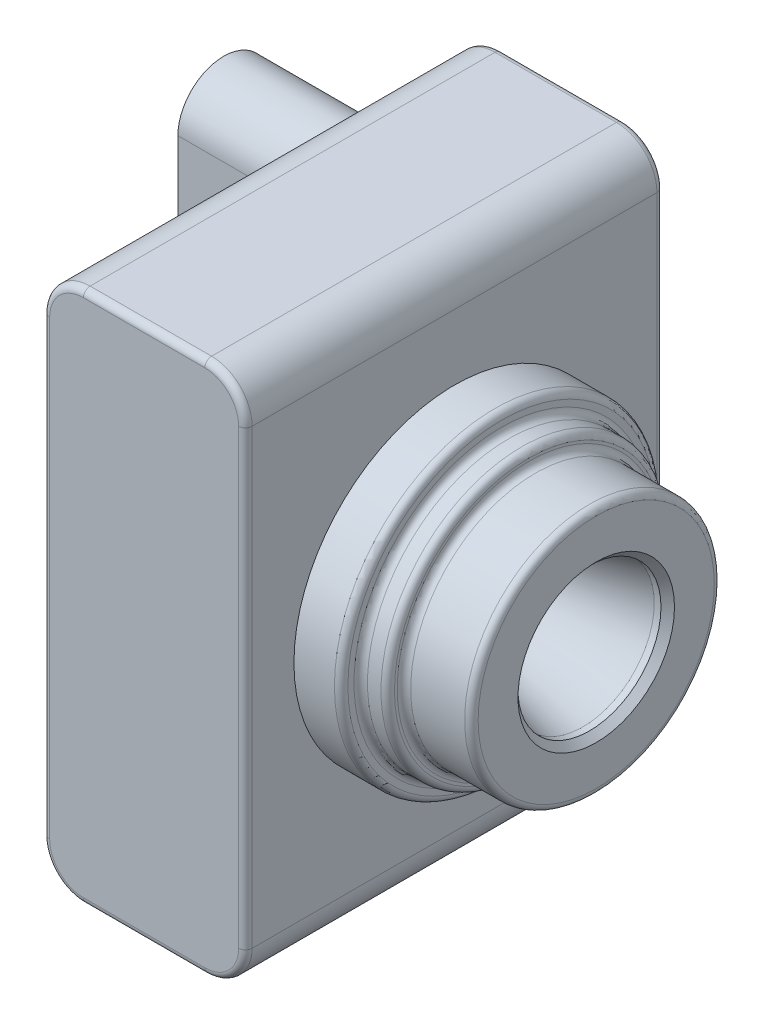
ISO-10303-21;
HEADER;
FILE_DESCRIPTION(('STEP AP214'),'2;1');
FILE_NAME('part.step','',(''),(''),'','','');
FILE_SCHEMA(('AUTOMOTIVE_DESIGN { 1 0 10303 214 1 1 1 1 }'));
ENDSEC;
DATA;
#1=APPLICATION_CONTEXT('core data for automotive mechanical design processes');
#2=APPLICATION_PROTOCOL_DEFINITION('international standard','automotive_design',2000,#1);
#3=PRODUCT_CONTEXT('',#1,'mechanical');
#4=PRODUCT('Part','Part','',(#3));
#5=PRODUCT_RELATED_PRODUCT_CATEGORY('part','',(#4));
#6=PRODUCT_DEFINITION_FORMATION('','',#4);
#7=PRODUCT_DEFINITION_CONTEXT('part definition',#1,'design');
#8=PRODUCT_DEFINITION('design','',#6,#7);
#9=PRODUCT_DEFINITION_SHAPE('','',#8);
#10=(LENGTH_UNIT() NAMED_UNIT(*) SI_UNIT(.MILLI.,.METRE.));
#11=(NAMED_UNIT(*) PLANE_ANGLE_UNIT() SI_UNIT($,.RADIAN.));
#12=(NAMED_UNIT(*) SI_UNIT($,.STERADIAN.) SOLID_ANGLE_UNIT());
#13=UNCERTAINTY_MEASURE_WITH_UNIT(LENGTH_MEASURE(1.E-05),#10,'distance_accuracy_value','');
#14=(GEOMETRIC_REPRESENTATION_CONTEXT(3) GLOBAL_UNCERTAINTY_ASSIGNED_CONTEXT((#13)) GLOBAL_UNIT_ASSIGNED_CONTEXT((#10,
#11,#12)) REPRESENTATION_CONTEXT('',''));
#15=CARTESIAN_POINT('',(0.,0.,0.));
#16=DIRECTION('',(0.,0.,1.));
#17=DIRECTION('',(1.,0.,0.));
#18=AXIS2_PLACEMENT_3D('',#15,#16,#17);
#19=CARTESIAN_POINT('',(-7.50000000000001,-16.75,31.));
#20=DIRECTION('',(1.,0.,0.));
#21=DIRECTION('',(0.,0.,-1.));
#22=AXIS2_PLACEMENT_3D('',#19,#20,#21);
#23=PLANE('',#22);
#24=DIRECTION('',(0.,0.,-1.));
#25=VECTOR('',#24,1.);
#26=CARTESIAN_POINT('',(-7.50000000000001,16.75,31.));
#27=LINE('',#26,#25);
#28=CARTESIAN_POINT('',(-7.50000000000001,16.75,30.5));
#29=VERTEX_POINT('',#28);
#30=CARTESIAN_POINT('',(-7.50000000000001,16.75,0.5));
#31=VERTEX_POINT('',#30);
#32=EDGE_CURVE('E217',#29,#31,#27,.T.);
#33=ORIENTED_EDGE('',*,*,#32,.T.);
#34=DIRECTION('',(0.,-1.,0.));
#35=VECTOR('',#34,1.);
#36=CARTESIAN_POINT('',(-7.50000000000001,-16.75,0.5));
#37=LINE('',#36,#35);
#38=CARTESIAN_POINT('',(-7.5,-16.75,0.5));
#39=VERTEX_POINT('',#38);
#40=EDGE_CURVE('E11',#31,#39,#37,.T.);
#41=ORIENTED_EDGE('',*,*,#40,.T.);
#42=DIRECTION('',(0.,0.,-1.));
#43=VECTOR('',#42,1.);
#44=CARTESIAN_POINT('',(-7.5,-16.75,31.));
#45=LINE('',#44,#43);
#46=CARTESIAN_POINT('',(-7.5,-16.75,30.5));
#47=VERTEX_POINT('',#46);
#48=EDGE_CURVE('E214',#47,#39,#45,.T.);
#49=ORIENTED_EDGE('',*,*,#48,.F.);
#50=DIRECTION('',(0.,-1.,0.));
#51=VECTOR('',#50,1.);
#52=CARTESIAN_POINT('',(-7.50000000000001,16.75,30.5));
#53=LINE('',#52,#51);
#54=EDGE_CURVE('E43',#47,#29,#53,.F.);
#55=ORIENTED_EDGE('',*,*,#54,.T.);
#56=EDGE_LOOP('',(#33,#41,#49,#55));
#57=FACE_BOUND('',#56,.T.);
#58=CARTESIAN_POINT('',(-7.50000000000001,13.15,7.6));
#59=DIRECTION('',(-1.,0.,0.));
#60=DIRECTION('',(0.,0.,1.));
#61=AXIS2_PLACEMENT_3D('',#58,#59,#60);
#62=CIRCLE('',#61,3.4);
#63=CARTESIAN_POINT('',(-7.50000000000001,13.15,11.));
#64=VERTEX_POINT('',#63);
#65=CARTESIAN_POINT('',(-7.50000000000001,13.15,4.2));
#66=VERTEX_POINT('',#65);
#67=EDGE_CURVE('E196',#64,#66,#62,.T.);
#68=ORIENTED_EDGE('',*,*,#67,.F.);
#69=DIRECTION('',(0.,1.,0.));
#70=VECTOR('',#69,1.);
#71=CARTESIAN_POINT('',(-7.50000000000001,13.15,11.));
#72=LINE('',#71,#70);
#73=CARTESIAN_POINT('',(-7.50000000000001,-11.85,11.));
#74=VERTEX_POINT('',#73);
#75=EDGE_CURVE('E193',#74,#64,#72,.T.);
#76=ORIENTED_EDGE('',*,*,#75,.F.);
#77=DIRECTION('',(0.,0.,1.));
#78=VECTOR('',#77,1.);
#79=CARTESIAN_POINT('',(-7.50000000000001,-11.85,11.));
#80=LINE('',#79,#78);
#81=CARTESIAN_POINT('',(-7.50000000000001,-11.85,4.2));
#82=VERTEX_POINT('',#81);
#83=EDGE_CURVE('E989',#82,#74,#80,.T.);
#84=ORIENTED_EDGE('',*,*,#83,.F.);
#85=DIRECTION('',(0.,-1.,0.));
#86=VECTOR('',#85,1.);
#87=CARTESIAN_POINT('',(-7.50000000000001,-11.85,4.2));
#88=LINE('',#87,#86);
#89=EDGE_CURVE('E991',#66,#82,#88,.T.);
#90=ORIENTED_EDGE('',*,*,#89,.F.);
#91=EDGE_LOOP('',(#68,#76,#84,#90));
#92=FACE_BOUND('',#91,.T.);
#93=ADVANCED_FACE('F34',(#57,#92),#23,.F.);
#94=CARTESIAN_POINT('',(4.5,-16.75,31.));
#95=DIRECTION('',(0.,0.,-1.));
#96=DIRECTION('',(-1.,0.,0.));
#97=AXIS2_PLACEMENT_3D('',#94,#95,#96);
#98=CYLINDRICAL_SURFACE('',#97,3.);
#99=DIRECTION('',(0.,0.,-1.));
#100=VECTOR('',#99,1.);
#101=CARTESIAN_POINT('',(4.5,-19.75,31.));
#102=LINE('',#101,#100);
#103=CARTESIAN_POINT('',(4.5,-19.75,30.5));
#104=VERTEX_POINT('',#103);
#105=CARTESIAN_POINT('',(4.5,-19.75,0.5));
#106=VERTEX_POINT('',#105);
#107=EDGE_CURVE('E207',#104,#106,#102,.T.);
#108=ORIENTED_EDGE('',*,*,#107,.T.);
#109=CARTESIAN_POINT('',(4.5,-16.75,0.5));
#110=DIRECTION('',(0.,0.,1.));
#111=DIRECTION('',(1.,0.,0.));
#112=AXIS2_PLACEMENT_3D('',#109,#110,#111);
#113=CIRCLE('',#112,3.);
#114=CARTESIAN_POINT('',(7.5,-16.75,0.5));
#115=VERTEX_POINT('',#114);
#116=EDGE_CURVE('E314',#106,#115,#113,.T.);
#117=ORIENTED_EDGE('',*,*,#116,.T.);
#118=DIRECTION('',(0.,0.,-1.));
#119=VECTOR('',#118,1.);
#120=CARTESIAN_POINT('',(7.5,-16.75,31.));
#121=LINE('',#120,#119);
#122=CARTESIAN_POINT('',(7.5,-16.75,30.5));
#123=VERTEX_POINT('',#122);
#124=EDGE_CURVE('E229',#123,#115,#121,.T.);
#125=ORIENTED_EDGE('',*,*,#124,.F.);
#126=CARTESIAN_POINT('',(4.5,-16.75,30.5));
#127=DIRECTION('',(0.,0.,1.));
#128=DIRECTION('',(1.,0.,0.));
#129=AXIS2_PLACEMENT_3D('',#126,#127,#128);
#130=CIRCLE('',#129,3.);
#131=EDGE_CURVE('E312',#123,#104,#130,.F.);
#132=ORIENTED_EDGE('',*,*,#131,.T.);
#133=EDGE_LOOP('',(#108,#117,#125,#132));
#134=FACE_BOUND('',#133,.T.);
#135=ADVANCED_FACE('F395',(#134),#98,.T.);
#136=CARTESIAN_POINT('',(7.5,-16.75,31.));
#137=DIRECTION('',(-1.,0.,0.));
#138=DIRECTION('',(0.,0.,1.));
#139=AXIS2_PLACEMENT_3D('',#136,#137,#138);
#140=PLANE('',#139);
#141=CARTESIAN_POINT('',(7.5,0.,15.5));
#142=DIRECTION('',(-1.,0.,0.));
#143=DIRECTION('',(0.,0.,1.));
#144=AXIS2_PLACEMENT_3D('',#141,#142,#143);
#145=CIRCLE('',#144,11.9);
#146=CARTESIAN_POINT('',(7.5,0.,27.4));
#147=VERTEX_POINT('',#146);
#148=EDGE_CURVE('E232',#147,#147,#145,.F.);
#149=ORIENTED_EDGE('',*,*,#148,.F.);
#150=EDGE_LOOP('',(#149));
#151=FACE_BOUND('',#150,.T.);
#152=ORIENTED_EDGE('',*,*,#124,.T.);
#153=DIRECTION('',(0.,1.,0.));
#154=VECTOR('',#153,1.);
#155=CARTESIAN_POINT('',(7.5,-16.75,0.5));
#156=LINE('',#155,#154);
#157=CARTESIAN_POINT('',(7.5,16.75,0.5));
#158=VERTEX_POINT('',#157);
#159=EDGE_CURVE('E310',#115,#158,#156,.T.);
#160=ORIENTED_EDGE('',*,*,#159,.T.);
#161=DIRECTION('',(0.,0.,-1.));
#162=VECTOR('',#161,1.);
#163=CARTESIAN_POINT('',(7.5,16.75,31.));
#164=LINE('',#163,#162);
#165=CARTESIAN_POINT('',(7.5,16.75,30.5));
#166=VERTEX_POINT('',#165);
#167=EDGE_CURVE('E226',#166,#158,#164,.T.);
#168=ORIENTED_EDGE('',*,*,#167,.F.);
#169=DIRECTION('',(0.,1.,0.));
#170=VECTOR('',#169,1.);
#171=CARTESIAN_POINT('',(7.5,-16.75,30.5));
#172=LINE('',#171,#170);
#173=EDGE_CURVE('E308',#166,#123,#172,.F.);
#174=ORIENTED_EDGE('',*,*,#173,.T.);
#175=EDGE_LOOP('',(#152,#160,#168,#174));
#176=FACE_BOUND('',#175,.T.);
#177=ADVANCED_FACE('F422',(#151,#176),#140,.F.);
#178=CARTESIAN_POINT('',(4.5,16.75,31.));
#179=DIRECTION('',(0.,0.,-1.));
#180=DIRECTION('',(-1.,0.,0.));
#181=AXIS2_PLACEMENT_3D('',#178,#179,#180);
#182=CYLINDRICAL_SURFACE('',#181,3.);
#183=ORIENTED_EDGE('',*,*,#167,.T.);
#184=CARTESIAN_POINT('',(4.5,16.75,0.5));
#185=DIRECTION('',(0.,0.,1.));
#186=DIRECTION('',(1.,0.,0.));
#187=AXIS2_PLACEMENT_3D('',#184,#185,#186);
#188=CIRCLE('',#187,3.);
#189=CARTESIAN_POINT('',(4.5,19.75,0.5));
#190=VERTEX_POINT('',#189);
#191=EDGE_CURVE('E306',#158,#190,#188,.T.);
#192=ORIENTED_EDGE('',*,*,#191,.T.);
#193=DIRECTION('',(0.,0.,-1.));
#194=VECTOR('',#193,1.);
#195=CARTESIAN_POINT('',(4.5,19.75,31.));
#196=LINE('',#195,#194);
#197=CARTESIAN_POINT('',(4.5,19.75,30.5));
#198=VERTEX_POINT('',#197);
#199=EDGE_CURVE('E223',#198,#190,#196,.T.);
#200=ORIENTED_EDGE('',*,*,#199,.F.);
#201=CARTESIAN_POINT('',(4.5,16.75,30.5));
#202=DIRECTION('',(0.,0.,1.));
#203=DIRECTION('',(1.,0.,0.));
#204=AXIS2_PLACEMENT_3D('',#201,#202,#203);
#205=CIRCLE('',#204,3.);
#206=EDGE_CURVE('E304',#198,#166,#205,.F.);
#207=ORIENTED_EDGE('',*,*,#206,.T.);
#208=EDGE_LOOP('',(#183,#192,#200,#207));
#209=FACE_BOUND('',#208,.T.);
#210=ADVANCED_FACE('F426',(#209),#182,.T.);
#211=CARTESIAN_POINT('',(-4.5,19.75,31.));
#212=DIRECTION('',(0.,-1.,0.));
#213=DIRECTION('',(0.,0.,-1.));
#214=AXIS2_PLACEMENT_3D('',#211,#212,#213);
#215=PLANE('',#214);
#216=ORIENTED_EDGE('',*,*,#199,.T.);
#217=DIRECTION('',(-1.,0.,0.));
#218=VECTOR('',#217,1.);
#219=CARTESIAN_POINT('',(-4.5,19.75,0.5));
#220=LINE('',#219,#218);
#221=CARTESIAN_POINT('',(-4.5,19.75,0.5));
#222=VERTEX_POINT('',#221);
#223=EDGE_CURVE('E302',#190,#222,#220,.T.);
#224=ORIENTED_EDGE('',*,*,#223,.T.);
#225=DIRECTION('',(0.,0.,-1.));
#226=VECTOR('',#225,1.);
#227=CARTESIAN_POINT('',(-4.5,19.75,31.));
#228=LINE('',#227,#226);
#229=CARTESIAN_POINT('',(-4.5,19.75,30.5));
#230=VERTEX_POINT('',#229);
#231=EDGE_CURVE('E220',#230,#222,#228,.T.);
#232=ORIENTED_EDGE('',*,*,#231,.F.);
#233=DIRECTION('',(-1.,0.,0.));
#234=VECTOR('',#233,1.);
#235=CARTESIAN_POINT('',(4.5,19.75,30.5));
#236=LINE('',#235,#234);
#237=EDGE_CURVE('E300',#230,#198,#236,.F.);
#238=ORIENTED_EDGE('',*,*,#237,.T.);
#239=EDGE_LOOP('',(#216,#224,#232,#238));
#240=FACE_BOUND('',#239,.T.);
#241=ADVANCED_FACE('F444',(#240),#215,.F.);
#242=CARTESIAN_POINT('',(-4.5,16.75,31.));
#243=DIRECTION('',(0.,0.,-1.));
#244=DIRECTION('',(-1.,0.,0.));
#245=AXIS2_PLACEMENT_3D('',#242,#243,#244);
#246=CYLINDRICAL_SURFACE('',#245,3.);
#247=ORIENTED_EDGE('',*,*,#231,.T.);
#248=CARTESIAN_POINT('',(-4.5,16.75,0.5));
#249=DIRECTION('',(0.,0.,1.));
#250=DIRECTION('',(1.,0.,0.));
#251=AXIS2_PLACEMENT_3D('',#248,#249,#250);
#252=CIRCLE('',#251,3.);
#253=EDGE_CURVE('E280',#222,#31,#252,.T.);
#254=ORIENTED_EDGE('',*,*,#253,.T.);
#255=ORIENTED_EDGE('',*,*,#32,.F.);
#256=CARTESIAN_POINT('',(-4.5,16.75,30.5));
#257=DIRECTION('',(0.,0.,1.));
#258=DIRECTION('',(1.,0.,0.));
#259=AXIS2_PLACEMENT_3D('',#256,#257,#258);
#260=CIRCLE('',#259,3.);
#261=EDGE_CURVE('E277',#29,#230,#260,.F.);
#262=ORIENTED_EDGE('',*,*,#261,.T.);
#263=EDGE_LOOP('',(#247,#254,#255,#262));
#264=FACE_BOUND('',#263,.T.);
#265=ADVANCED_FACE('F446',(#264),#246,.T.);
#266=CARTESIAN_POINT('',(-4.5,-16.75,31.));
#267=DIRECTION('',(0.,0.,-1.));
#268=DIRECTION('',(-1.,0.,0.));
#269=AXIS2_PLACEMENT_3D('',#266,#267,#268);
#270=CYLINDRICAL_SURFACE('',#269,3.);
#271=ORIENTED_EDGE('',*,*,#48,.T.);
#272=CARTESIAN_POINT('',(-4.5,-16.75,0.5));
#273=DIRECTION('',(0.,0.,1.));
#274=DIRECTION('',(1.,0.,0.));
#275=AXIS2_PLACEMENT_3D('',#272,#273,#274);
#276=CIRCLE('',#275,3.);
#277=CARTESIAN_POINT('',(-4.5,-19.75,0.5));
#278=VERTEX_POINT('',#277);
#279=EDGE_CURVE('E322',#39,#278,#276,.T.);
#280=ORIENTED_EDGE('',*,*,#279,.T.);
#281=DIRECTION('',(0.,0.,-1.));
#282=VECTOR('',#281,1.);
#283=CARTESIAN_POINT('',(-4.5,-19.75,31.));
#284=LINE('',#283,#282);
#285=CARTESIAN_POINT('',(-4.5,-19.75,30.5));
#286=VERTEX_POINT('',#285);
#287=EDGE_CURVE('E211',#286,#278,#284,.T.);
#288=ORIENTED_EDGE('',*,*,#287,.F.);
#289=CARTESIAN_POINT('',(-4.5,-16.75,30.5));
#290=DIRECTION('',(0.,0.,1.));
#291=DIRECTION('',(1.,0.,0.));
#292=AXIS2_PLACEMENT_3D('',#289,#290,#291);
#293=CIRCLE('',#292,3.);
#294=EDGE_CURVE('E320',#286,#47,#293,.F.);
#295=ORIENTED_EDGE('',*,*,#294,.T.);
#296=EDGE_LOOP('',(#271,#280,#288,#295));
#297=FACE_BOUND('',#296,.T.);
#298=ADVANCED_FACE('F469',(#297),#270,.T.);
#299=CARTESIAN_POINT('',(-4.5,-19.75,31.));
#300=DIRECTION('',(0.,1.,0.));
#301=DIRECTION('',(0.,0.,1.));
#302=AXIS2_PLACEMENT_3D('',#299,#300,#301);
#303=PLANE('',#302);
#304=ORIENTED_EDGE('',*,*,#287,.T.);
#305=DIRECTION('',(1.,0.,0.));
#306=VECTOR('',#305,1.);
#307=CARTESIAN_POINT('',(-4.5,-19.75,0.5));
#308=LINE('',#307,#306);
#309=EDGE_CURVE('E318',#278,#106,#308,.T.);
#310=ORIENTED_EDGE('',*,*,#309,.T.);
#311=ORIENTED_EDGE('',*,*,#107,.F.);
#312=DIRECTION('',(1.,0.,0.));
#313=VECTOR('',#312,1.);
#314=CARTESIAN_POINT('',(-4.5,-19.75,30.5));
#315=LINE('',#314,#313);
#316=EDGE_CURVE('E316',#104,#286,#315,.F.);
#317=ORIENTED_EDGE('',*,*,#316,.T.);
#318=EDGE_LOOP('',(#304,#310,#311,#317));
#319=FACE_BOUND('',#318,.T.);
#320=ADVANCED_FACE('F398',(#319),#303,.F.);
#321=CARTESIAN_POINT('',(4.5,-16.75,31.));
#322=DIRECTION('',(0.,0.,1.));
#323=DIRECTION('',(1.,0.,0.));
#324=AXIS2_PLACEMENT_3D('',#321,#322,#323);
#325=PLANE('',#324);
#326=DIRECTION('',(-1.,0.,0.));
#327=VECTOR('',#326,1.);
#328=CARTESIAN_POINT('',(-4.5,19.25,31.));
#329=LINE('',#328,#327);
#330=CARTESIAN_POINT('',(4.5,19.25,31.));
#331=VERTEX_POINT('',#330);
#332=CARTESIAN_POINT('',(-4.5,19.25,31.));
#333=VERTEX_POINT('',#332);
#334=EDGE_CURVE('E51',#331,#333,#329,.T.);
#335=ORIENTED_EDGE('',*,*,#334,.T.);
#336=CARTESIAN_POINT('',(-4.5,16.75,31.));
#337=DIRECTION('',(0.,0.,1.));
#338=DIRECTION('',(1.,0.,0.));
#339=AXIS2_PLACEMENT_3D('',#336,#337,#338);
#340=CIRCLE('',#339,2.5);
#341=CARTESIAN_POINT('',(-7.,16.75,31.));
#342=VERTEX_POINT('',#341);
#343=EDGE_CURVE('E336',#333,#342,#340,.T.);
#344=ORIENTED_EDGE('',*,*,#343,.T.);
#345=DIRECTION('',(0.,-1.,0.));
#346=VECTOR('',#345,1.);
#347=CARTESIAN_POINT('',(-7.,-16.75,31.));
#348=LINE('',#347,#346);
#349=CARTESIAN_POINT('',(-7.,-16.75,31.));
#350=VERTEX_POINT('',#349);
#351=EDGE_CURVE('E324',#342,#350,#348,.T.);
#352=ORIENTED_EDGE('',*,*,#351,.T.);
#353=CARTESIAN_POINT('',(-4.5,-16.75,31.));
#354=DIRECTION('',(0.,0.,1.));
#355=DIRECTION('',(1.,0.,0.));
#356=AXIS2_PLACEMENT_3D('',#353,#354,#355);
#357=CIRCLE('',#356,2.5);
#358=CARTESIAN_POINT('',(-4.5,-19.25,31.));
#359=VERTEX_POINT('',#358);
#360=EDGE_CURVE('E326',#350,#359,#357,.T.);
#361=ORIENTED_EDGE('',*,*,#360,.T.);
#362=DIRECTION('',(1.,0.,0.));
#363=VECTOR('',#362,1.);
#364=CARTESIAN_POINT('',(4.5,-19.25,31.));
#365=LINE('',#364,#363);
#366=CARTESIAN_POINT('',(4.5,-19.25,31.));
#367=VERTEX_POINT('',#366);
#368=EDGE_CURVE('E328',#359,#367,#365,.T.);
#369=ORIENTED_EDGE('',*,*,#368,.T.);
#370=CARTESIAN_POINT('',(4.5,-16.75,31.));
#371=DIRECTION('',(0.,0.,1.));
#372=DIRECTION('',(1.,0.,0.));
#373=AXIS2_PLACEMENT_3D('',#370,#371,#372);
#374=CIRCLE('',#373,2.5);
#375=CARTESIAN_POINT('',(7.,-16.75,31.));
#376=VERTEX_POINT('',#375);
#377=EDGE_CURVE('E330',#367,#376,#374,.T.);
#378=ORIENTED_EDGE('',*,*,#377,.T.);
#379=DIRECTION('',(0.,1.,0.));
#380=VECTOR('',#379,1.);
#381=CARTESIAN_POINT('',(7.,16.75,31.));
#382=LINE('',#381,#380);
#383=CARTESIAN_POINT('',(7.,16.75,31.));
#384=VERTEX_POINT('',#383);
#385=EDGE_CURVE('E332',#376,#384,#382,.T.);
#386=ORIENTED_EDGE('',*,*,#385,.T.);
#387=CARTESIAN_POINT('',(4.5,16.75,31.));
#388=DIRECTION('',(0.,0.,1.));
#389=DIRECTION('',(1.,0.,0.));
#390=AXIS2_PLACEMENT_3D('',#387,#388,#389);
#391=CIRCLE('',#390,2.5);
#392=EDGE_CURVE('E56',#384,#331,#391,.T.);
#393=ORIENTED_EDGE('',*,*,#392,.T.);
#394=EDGE_LOOP('',(#335,#344,#352,#361,#369,#378,#386,#393));
#395=FACE_BOUND('',#394,.T.);
#396=ADVANCED_FACE('F460',(#395),#325,.T.);
#397=CARTESIAN_POINT('',(4.5,-16.75,0.));
#398=DIRECTION('',(0.,0.,1.));
#399=DIRECTION('',(1.,0.,0.));
#400=AXIS2_PLACEMENT_3D('',#397,#398,#399);
#401=PLANE('',#400);
#402=DIRECTION('',(0.,-1.,0.));
#403=VECTOR('',#402,1.);
#404=CARTESIAN_POINT('',(-7.,-16.75,0.));
#405=LINE('',#404,#403);
#406=CARTESIAN_POINT('',(-7.,-16.75,0.));
#407=VERTEX_POINT('',#406);
#408=CARTESIAN_POINT('',(-7.,16.75,0.));
#409=VERTEX_POINT('',#408);
#410=EDGE_CURVE('E283',#407,#409,#405,.F.);
#411=ORIENTED_EDGE('',*,*,#410,.T.);
#412=CARTESIAN_POINT('',(-4.5,16.75,0.));
#413=DIRECTION('',(0.,0.,1.));
#414=DIRECTION('',(1.,0.,0.));
#415=AXIS2_PLACEMENT_3D('',#412,#413,#414);
#416=CIRCLE('',#415,2.5);
#417=CARTESIAN_POINT('',(-4.5,19.25,0.));
#418=VERTEX_POINT('',#417);
#419=EDGE_CURVE('E297',#409,#418,#416,.F.);
#420=ORIENTED_EDGE('',*,*,#419,.T.);
#421=DIRECTION('',(-1.,0.,0.));
#422=VECTOR('',#421,1.);
#423=CARTESIAN_POINT('',(4.5,19.25,0.));
#424=LINE('',#423,#422);
#425=CARTESIAN_POINT('',(4.5,19.25,0.));
#426=VERTEX_POINT('',#425);
#427=EDGE_CURVE('E295',#418,#426,#424,.F.);
#428=ORIENTED_EDGE('',*,*,#427,.T.);
#429=CARTESIAN_POINT('',(4.5,16.75,0.));
#430=DIRECTION('',(0.,0.,1.));
#431=DIRECTION('',(1.,0.,0.));
#432=AXIS2_PLACEMENT_3D('',#429,#430,#431);
#433=CIRCLE('',#432,2.5);
#434=CARTESIAN_POINT('',(7.,16.75,0.));
#435=VERTEX_POINT('',#434);
#436=EDGE_CURVE('E293',#426,#435,#433,.F.);
#437=ORIENTED_EDGE('',*,*,#436,.T.);
#438=DIRECTION('',(0.,1.,0.));
#439=VECTOR('',#438,1.);
#440=CARTESIAN_POINT('',(7.,-16.75,0.));
#441=LINE('',#440,#439);
#442=CARTESIAN_POINT('',(7.,-16.75,0.));
#443=VERTEX_POINT('',#442);
#444=EDGE_CURVE('E291',#435,#443,#441,.F.);
#445=ORIENTED_EDGE('',*,*,#444,.T.);
#446=CARTESIAN_POINT('',(4.5,-16.75,0.));
#447=DIRECTION('',(0.,0.,1.));
#448=DIRECTION('',(1.,0.,0.));
#449=AXIS2_PLACEMENT_3D('',#446,#447,#448);
#450=CIRCLE('',#449,2.5);
#451=CARTESIAN_POINT('',(4.5,-19.25,0.));
#452=VERTEX_POINT('',#451);
#453=EDGE_CURVE('E289',#443,#452,#450,.F.);
#454=ORIENTED_EDGE('',*,*,#453,.T.);
#455=DIRECTION('',(1.,0.,0.));
#456=VECTOR('',#455,1.);
#457=CARTESIAN_POINT('',(4.5,-19.25,0.));
#458=LINE('',#457,#456);
#459=CARTESIAN_POINT('',(-4.5,-19.25,0.));
#460=VERTEX_POINT('',#459);
#461=EDGE_CURVE('E287',#452,#460,#458,.F.);
#462=ORIENTED_EDGE('',*,*,#461,.T.);
#463=CARTESIAN_POINT('',(-4.5,-16.75,0.));
#464=DIRECTION('',(0.,0.,1.));
#465=DIRECTION('',(1.,0.,0.));
#466=AXIS2_PLACEMENT_3D('',#463,#464,#465);
#467=CIRCLE('',#466,2.5);
#468=EDGE_CURVE('E285',#460,#407,#467,.F.);
#469=ORIENTED_EDGE('',*,*,#468,.T.);
#470=EDGE_LOOP('',(#411,#420,#428,#437,#445,#454,#462,#469));
#471=FACE_BOUND('',#470,.T.);
#472=ADVANCED_FACE('F413',(#471),#401,.F.);
#473=CARTESIAN_POINT('',(11.,0.,15.5));
#474=DIRECTION('',(-1.,0.,0.));
#475=DIRECTION('',(0.,0.,1.));
#476=AXIS2_PLACEMENT_3D('',#473,#474,#475);
#477=CYLINDRICAL_SURFACE('',#476,11.9);
#478=CARTESIAN_POINT('',(10.5,0.,15.5));
#479=DIRECTION('',(1.,0.,0.));
#480=DIRECTION('',(0.,0.,-1.));
#481=AXIS2_PLACEMENT_3D('',#478,#479,#480);
#482=CIRCLE('',#481,11.9);
#483=CARTESIAN_POINT('',(10.5,0.,3.6));
#484=VERTEX_POINT('',#483);
#485=EDGE_CURVE('E262',#484,#484,#482,.F.);
#486=ORIENTED_EDGE('',*,*,#485,.T.);
#487=EDGE_LOOP('',(#486));
#488=FACE_BOUND('',#487,.T.);
#489=ORIENTED_EDGE('',*,*,#148,.T.);
#490=EDGE_LOOP('',(#489));
#491=FACE_BOUND('',#490,.T.);
#492=ADVANCED_FACE('F467',(#488,#491),#477,.T.);
#493=CARTESIAN_POINT('',(11.,0.,15.5));
#494=DIRECTION('',(1.,0.,0.));
#495=DIRECTION('',(0.,0.,-1.));
#496=AXIS2_PLACEMENT_3D('',#493,#494,#495);
#497=PLANE('',#496);
#498=CARTESIAN_POINT('',(11.,0.,15.5));
#499=DIRECTION('',(1.,0.,0.));
#500=DIRECTION('',(0.,0.,-1.));
#501=AXIS2_PLACEMENT_3D('',#498,#499,#500);
#502=CIRCLE('',#501,11.4);
#503=CARTESIAN_POINT('',(11.,0.,4.1));
#504=VERTEX_POINT('',#503);
#505=EDGE_CURVE('E259',#504,#504,#502,.T.);
#506=ORIENTED_EDGE('',*,*,#505,.T.);
#507=EDGE_LOOP('',(#506));
#508=FACE_BOUND('',#507,.T.);
#509=CARTESIAN_POINT('',(11.,0.,15.5));
#510=DIRECTION('',(1.,0.,0.));
#511=DIRECTION('',(0.,0.,-1.));
#512=AXIS2_PLACEMENT_3D('',#509,#510,#511);
#513=CIRCLE('',#512,10.95);
#514=CARTESIAN_POINT('',(11.,0.,4.55));
#515=VERTEX_POINT('',#514);
#516=EDGE_CURVE('E244',#515,#515,#513,.F.);
#517=ORIENTED_EDGE('',*,*,#516,.T.);
#518=EDGE_LOOP('',(#517));
#519=FACE_BOUND('',#518,.T.);
#520=ADVANCED_FACE('F724',(#508,#519),#497,.T.);
#521=CARTESIAN_POINT('',(13.,0.,15.5));
#522=DIRECTION('',(-1.,0.,0.));
#523=DIRECTION('',(0.,0.,1.));
#524=AXIS2_PLACEMENT_3D('',#521,#522,#523);
#525=CYLINDRICAL_SURFACE('',#524,10.45);
#526=CARTESIAN_POINT('',(12.5,0.,15.5));
#527=DIRECTION('',(1.,0.,0.));
#528=DIRECTION('',(0.,0.,-1.));
#529=AXIS2_PLACEMENT_3D('',#526,#527,#528);
#530=CIRCLE('',#529,10.45);
#531=CARTESIAN_POINT('',(12.5,0.,5.05));
#532=VERTEX_POINT('',#531);
#533=EDGE_CURVE('E256',#532,#532,#530,.F.);
#534=ORIENTED_EDGE('',*,*,#533,.T.);
#535=EDGE_LOOP('',(#534));
#536=FACE_BOUND('',#535,.T.);
#537=CARTESIAN_POINT('',(11.5,0.,15.5));
#538=DIRECTION('',(1.,0.,0.));
#539=DIRECTION('',(0.,0.,-1.));
#540=AXIS2_PLACEMENT_3D('',#537,#538,#539);
#541=CIRCLE('',#540,10.45);
#542=CARTESIAN_POINT('',(11.5,0.,5.05));
#543=VERTEX_POINT('',#542);
#544=EDGE_CURVE('E241',#543,#543,#541,.T.);
#545=ORIENTED_EDGE('',*,*,#544,.T.);
#546=EDGE_LOOP('',(#545));
#547=FACE_BOUND('',#546,.T.);
#548=ADVANCED_FACE('F716',(#536,#547),#525,.T.);
#549=CARTESIAN_POINT('',(13.,0.,15.5));
#550=DIRECTION('',(1.,0.,0.));
#551=DIRECTION('',(0.,0.,-1.));
#552=AXIS2_PLACEMENT_3D('',#549,#550,#551);
#553=PLANE('',#552);
#554=CARTESIAN_POINT('',(13.,0.,15.5));
#555=DIRECTION('',(1.,0.,0.));
#556=DIRECTION('',(0.,0.,-1.));
#557=AXIS2_PLACEMENT_3D('',#554,#555,#556);
#558=CIRCLE('',#557,9.95);
#559=CARTESIAN_POINT('',(13.,0.,5.55));
#560=VERTEX_POINT('',#559);
#561=EDGE_CURVE('E253',#560,#560,#558,.T.);
#562=ORIENTED_EDGE('',*,*,#561,.T.);
#563=EDGE_LOOP('',(#562));
#564=FACE_BOUND('',#563,.T.);
#565=CARTESIAN_POINT('',(13.,0.,15.5));
#566=DIRECTION('',(1.,0.,0.));
#567=DIRECTION('',(0.,0.,-1.));
#568=AXIS2_PLACEMENT_3D('',#565,#566,#567);
#569=CIRCLE('',#568,9.75);
#570=CARTESIAN_POINT('',(13.,0.,5.75));
#571=VERTEX_POINT('',#570);
#572=EDGE_CURVE('E238',#571,#571,#569,.F.);
#573=ORIENTED_EDGE('',*,*,#572,.T.);
#574=EDGE_LOOP('',(#573));
#575=FACE_BOUND('',#574,.T.);
#576=ADVANCED_FACE('F707',(#564,#575),#553,.T.);
#577=CARTESIAN_POINT('',(18.,0.,15.5));
#578=DIRECTION('',(-1.,0.,0.));
#579=DIRECTION('',(0.,0.,1.));
#580=AXIS2_PLACEMENT_3D('',#577,#578,#579);
#581=CYLINDRICAL_SURFACE('',#580,9.25);
#582=CARTESIAN_POINT('',(17.5,0.,15.5));
#583=DIRECTION('',(1.,0.,0.));
#584=DIRECTION('',(0.,0.,-1.));
#585=AXIS2_PLACEMENT_3D('',#582,#583,#584);
#586=CIRCLE('',#585,9.25);
#587=CARTESIAN_POINT('',(17.5,0.,6.25));
#588=VERTEX_POINT('',#587);
#589=EDGE_CURVE('E250',#588,#588,#586,.F.);
#590=ORIENTED_EDGE('',*,*,#589,.T.);
#591=EDGE_LOOP('',(#590));
#592=FACE_BOUND('',#591,.T.);
#593=CARTESIAN_POINT('',(13.5,0.,15.5));
#594=DIRECTION('',(1.,0.,0.));
#595=DIRECTION('',(0.,0.,-1.));
#596=AXIS2_PLACEMENT_3D('',#593,#594,#595);
#597=CIRCLE('',#596,9.25);
#598=CARTESIAN_POINT('',(13.5,0.,6.25));
#599=VERTEX_POINT('',#598);
#600=EDGE_CURVE('E235',#599,#599,#597,.T.);
#601=ORIENTED_EDGE('',*,*,#600,.T.);
#602=EDGE_LOOP('',(#601));
#603=FACE_BOUND('',#602,.T.);
#604=ADVANCED_FACE('F700',(#592,#603),#581,.T.);
#605=CARTESIAN_POINT('',(18.,0.,15.5));
#606=DIRECTION('',(1.,0.,0.));
#607=DIRECTION('',(0.,0.,-1.));
#608=AXIS2_PLACEMENT_3D('',#605,#606,#607);
#609=PLANE('',#608);
#610=CARTESIAN_POINT('',(18.,0.,15.5));
#611=DIRECTION('',(1.,0.,0.));
#612=DIRECTION('',(0.,0.,-1.));
#613=AXIS2_PLACEMENT_3D('',#610,#611,#612);
#614=CIRCLE('',#613,5.8);
#615=CARTESIAN_POINT('',(18.,0.,9.7));
#616=VERTEX_POINT('',#615);
#617=EDGE_CURVE('E268',#616,#616,#614,.F.);
#618=ORIENTED_EDGE('',*,*,#617,.T.);
#619=EDGE_LOOP('',(#618));
#620=FACE_BOUND('',#619,.T.);
#621=CARTESIAN_POINT('',(18.,0.,15.5));
#622=DIRECTION('',(1.,0.,0.));
#623=DIRECTION('',(0.,0.,-1.));
#624=AXIS2_PLACEMENT_3D('',#621,#622,#623);
#625=CIRCLE('',#624,8.75);
#626=CARTESIAN_POINT('',(18.,0.,6.75));
#627=VERTEX_POINT('',#626);
#628=EDGE_CURVE('E247',#627,#627,#625,.T.);
#629=ORIENTED_EDGE('',*,*,#628,.T.);
#630=EDGE_LOOP('',(#629));
#631=FACE_BOUND('',#630,.T.);
#632=ADVANCED_FACE('F693',(#620,#631),#609,.T.);
#633=CARTESIAN_POINT('',(0.999999999999997,0.,15.5));
#634=DIRECTION('',(1.,0.,0.));
#635=DIRECTION('',(0.,0.,-1.));
#636=AXIS2_PLACEMENT_3D('',#633,#634,#635);
#637=CYLINDRICAL_SURFACE('',#636,5.3);
#638=CARTESIAN_POINT('',(16.9999999999997,0.,15.5));
#639=DIRECTION('',(1.,0.,0.));
#640=DIRECTION('',(0.,0.,-1.));
#641=AXIS2_PLACEMENT_3D('',#638,#639,#640);
#642=CIRCLE('',#641,5.3);
#643=CARTESIAN_POINT('',(16.9999999999997,0.,10.2));
#644=VERTEX_POINT('',#643);
#645=EDGE_CURVE('E274',#644,#644,#642,.F.);
#646=ORIENTED_EDGE('',*,*,#645,.T.);
#647=EDGE_LOOP('',(#646));
#648=FACE_BOUND('',#647,.T.);
#649=CARTESIAN_POINT('',(17.5,0.,15.5));
#650=DIRECTION('',(1.,0.,0.));
#651=DIRECTION('',(0.,0.,-1.));
#652=AXIS2_PLACEMENT_3D('',#649,#650,#651);
#653=CIRCLE('',#652,5.3);
#654=CARTESIAN_POINT('',(17.5,0.,10.2));
#655=VERTEX_POINT('',#654);
#656=EDGE_CURVE('E265',#655,#655,#653,.T.);
#657=ORIENTED_EDGE('',*,*,#656,.T.);
#658=EDGE_LOOP('',(#657));
#659=FACE_BOUND('',#658,.T.);
#660=ADVANCED_FACE('F686',(#648,#659),#637,.F.);
#661=CARTESIAN_POINT('',(0.999999999999997,0.,15.5));
#662=DIRECTION('',(1.,0.,0.));
#663=DIRECTION('',(0.,0.,-1.));
#664=AXIS2_PLACEMENT_3D('',#661,#662,#663);
#665=PLANE('',#664);
#666=CARTESIAN_POINT('',(0.999999999999997,0.,15.5));
#667=DIRECTION('',(1.,0.,0.));
#668=DIRECTION('',(0.,0.,-1.));
#669=AXIS2_PLACEMENT_3D('',#666,#667,#668);
#670=CIRCLE('',#669,1.31075195450912);
#671=CARTESIAN_POINT('',(0.999999999999997,0.,14.1892480454909));
#672=VERTEX_POINT('',#671);
#673=EDGE_CURVE('E271',#672,#672,#670,.T.);
#674=ORIENTED_EDGE('',*,*,#673,.T.);
#675=EDGE_LOOP('',(#674));
#676=FACE_BOUND('',#675,.T.);
#677=CARTESIAN_POINT('',(0.999999999999997,0.,15.5));
#678=DIRECTION('',(1.,0.,0.));
#679=DIRECTION('',(0.,0.,-1.));
#680=AXIS2_PLACEMENT_3D('',#677,#678,#679);
#681=CIRCLE('',#680,1.15415768431118);
#682=CARTESIAN_POINT('',(0.999999999999997,0.,14.3458423156888));
#683=VERTEX_POINT('',#682);
#684=EDGE_CURVE('E197',#683,#683,#681,.T.);
#685=ORIENTED_EDGE('',*,*,#684,.F.);
#686=EDGE_LOOP('',(#685));
#687=FACE_BOUND('',#686,.T.);
#688=ADVANCED_FACE('F495',(#676,#687),#665,.T.);
#689=CARTESIAN_POINT('',(13.5,0.,15.5));
#690=DIRECTION('',(1.,0.,0.));
#691=DIRECTION('',(0.,0.,-1.));
#692=AXIS2_PLACEMENT_3D('',#689,#690,#691);
#693=TOROIDAL_SURFACE('',#692,9.75,0.5);
#694=ORIENTED_EDGE('',*,*,#572,.F.);
#695=EDGE_LOOP('',(#694));
#696=FACE_BOUND('',#695,.T.);
#697=ORIENTED_EDGE('',*,*,#600,.F.);
#698=EDGE_LOOP('',(#697));
#699=FACE_BOUND('',#698,.T.);
#700=ADVANCED_FACE('F491',(#696,#699),#693,.F.);
#701=CARTESIAN_POINT('',(11.5,0.,15.5));
#702=DIRECTION('',(1.,0.,0.));
#703=DIRECTION('',(0.,0.,-1.));
#704=AXIS2_PLACEMENT_3D('',#701,#702,#703);
#705=TOROIDAL_SURFACE('',#704,10.95,0.5);
#706=ORIENTED_EDGE('',*,*,#516,.F.);
#707=EDGE_LOOP('',(#706));
#708=FACE_BOUND('',#707,.T.);
#709=ORIENTED_EDGE('',*,*,#544,.F.);
#710=EDGE_LOOP('',(#709));
#711=FACE_BOUND('',#710,.T.);
#712=ADVANCED_FACE('F494',(#708,#711),#705,.F.);
#713=CARTESIAN_POINT('',(17.5,0.,15.5));
#714=DIRECTION('',(1.,0.,0.));
#715=DIRECTION('',(0.,0.,-1.));
#716=AXIS2_PLACEMENT_3D('',#713,#714,#715);
#717=TOROIDAL_SURFACE('',#716,8.75,0.5);
#718=ORIENTED_EDGE('',*,*,#589,.F.);
#719=EDGE_LOOP('',(#718));
#720=FACE_BOUND('',#719,.T.);
#721=ORIENTED_EDGE('',*,*,#628,.F.);
#722=EDGE_LOOP('',(#721));
#723=FACE_BOUND('',#722,.T.);
#724=ADVANCED_FACE('F499',(#720,#723),#717,.T.);
#725=CARTESIAN_POINT('',(12.5,0.,15.5));
#726=DIRECTION('',(1.,0.,0.));
#727=DIRECTION('',(0.,0.,-1.));
#728=AXIS2_PLACEMENT_3D('',#725,#726,#727);
#729=TOROIDAL_SURFACE('',#728,9.95,0.5);
#730=ORIENTED_EDGE('',*,*,#533,.F.);
#731=EDGE_LOOP('',(#730));
#732=FACE_BOUND('',#731,.T.);
#733=ORIENTED_EDGE('',*,*,#561,.F.);
#734=EDGE_LOOP('',(#733));
#735=FACE_BOUND('',#734,.T.);
#736=ADVANCED_FACE('F503',(#732,#735),#729,.T.);
#737=CARTESIAN_POINT('',(10.5,0.,15.5));
#738=DIRECTION('',(1.,0.,0.));
#739=DIRECTION('',(0.,0.,-1.));
#740=AXIS2_PLACEMENT_3D('',#737,#738,#739);
#741=TOROIDAL_SURFACE('',#740,11.4,0.5);
#742=ORIENTED_EDGE('',*,*,#485,.F.);
#743=EDGE_LOOP('',(#742));
#744=FACE_BOUND('',#743,.T.);
#745=ORIENTED_EDGE('',*,*,#505,.F.);
#746=EDGE_LOOP('',(#745));
#747=FACE_BOUND('',#746,.T.);
#748=ADVANCED_FACE('F507',(#744,#747),#741,.T.);
#749=CARTESIAN_POINT('',(17.5,0.,15.5));
#750=DIRECTION('',(1.,0.,0.));
#751=DIRECTION('',(0.,0.,-1.));
#752=AXIS2_PLACEMENT_3D('',#749,#750,#751);
#753=CONICAL_SURFACE('',#752,5.3,0.785398163397455);
#754=ORIENTED_EDGE('',*,*,#617,.F.);
#755=EDGE_LOOP('',(#754));
#756=FACE_BOUND('',#755,.T.);
#757=ORIENTED_EDGE('',*,*,#656,.F.);
#758=EDGE_LOOP('',(#757));
#759=FACE_BOUND('',#758,.T.);
#760=ADVANCED_FACE('F511',(#756,#759),#753,.F.);
#761=CARTESIAN_POINT('',(-1.,0.,15.5));
#762=DIRECTION('',(1.,0.,0.));
#763=DIRECTION('',(0.,0.,-1.));
#764=AXIS2_PLACEMENT_3D('',#761,#762,#763);
#765=CYLINDRICAL_SURFACE('',#764,1.15415768431118);
#766=CARTESIAN_POINT('',(-1.,0.,15.5));
#767=DIRECTION('',(1.,0.,0.));
#768=DIRECTION('',(0.,0.,-1.));
#769=AXIS2_PLACEMENT_3D('',#766,#767,#768);
#770=CIRCLE('',#769,1.15415768431118);
#771=CARTESIAN_POINT('',(-1.,0.,14.3458423156888));
#772=VERTEX_POINT('',#771);
#773=EDGE_CURVE('E200',#772,#772,#770,.T.);
#774=ORIENTED_EDGE('',*,*,#773,.F.);
#775=EDGE_LOOP('',(#774));
#776=FACE_BOUND('',#775,.T.);
#777=ORIENTED_EDGE('',*,*,#684,.T.);
#778=EDGE_LOOP('',(#777));
#779=FACE_BOUND('',#778,.T.);
#780=ADVANCED_FACE('F515',(#776,#779),#765,.F.);
#781=CARTESIAN_POINT('',(-1.,0.,15.5));
#782=DIRECTION('',(1.,0.,0.));
#783=DIRECTION('',(0.,0.,-1.));
#784=AXIS2_PLACEMENT_3D('',#781,#782,#783);
#785=PLANE('',#784);
#786=ORIENTED_EDGE('',*,*,#773,.T.);
#787=EDGE_LOOP('',(#786));
#788=FACE_BOUND('',#787,.T.);
#789=ADVANCED_FACE('F520',(#788),#785,.T.);
#790=CARTESIAN_POINT('',(0.999999999999997,0.,15.5));
#791=DIRECTION('',(1.,0.,0.));
#792=DIRECTION('',(0.,0.,-1.));
#793=AXIS2_PLACEMENT_3D('',#790,#791,#792);
#794=CONICAL_SURFACE('',#793,1.31075195450912,0.244346095279211);
#795=ORIENTED_EDGE('',*,*,#645,.F.);
#796=EDGE_LOOP('',(#795));
#797=FACE_BOUND('',#796,.T.);
#798=ORIENTED_EDGE('',*,*,#673,.F.);
#799=EDGE_LOOP('',(#798));
#800=FACE_BOUND('',#799,.T.);
#801=ADVANCED_FACE('F517',(#797,#800),#794,.F.);
#802=CARTESIAN_POINT('',(-17.5,13.15,7.6));
#803=DIRECTION('',(1.,0.,0.));
#804=DIRECTION('',(0.,0.,-1.));
#805=AXIS2_PLACEMENT_3D('',#802,#803,#804);
#806=CYLINDRICAL_SURFACE('',#805,3.4);
#807=ORIENTED_EDGE('',*,*,#67,.T.);
#808=DIRECTION('',(1.,0.,0.));
#809=VECTOR('',#808,1.);
#810=CARTESIAN_POINT('',(-17.5,13.15,4.2));
#811=LINE('',#810,#809);
#812=CARTESIAN_POINT('',(-17.5,13.15,4.2));
#813=VERTEX_POINT('',#812);
#814=EDGE_CURVE('E177',#813,#66,#811,.T.);
#815=ORIENTED_EDGE('',*,*,#814,.F.);
#816=CARTESIAN_POINT('',(-17.5,13.15,7.6));
#817=DIRECTION('',(-1.,0.,0.));
#818=DIRECTION('',(0.,0.,1.));
#819=AXIS2_PLACEMENT_3D('',#816,#817,#818);
#820=CIRCLE('',#819,3.4);
#821=CARTESIAN_POINT('',(-17.5,13.15,11.));
#822=VERTEX_POINT('',#821);
#823=EDGE_CURVE('E184',#822,#813,#820,.T.);
#824=ORIENTED_EDGE('',*,*,#823,.F.);
#825=DIRECTION('',(1.,0.,0.));
#826=VECTOR('',#825,1.);
#827=CARTESIAN_POINT('',(-17.5,13.15,11.));
#828=LINE('',#827,#826);
#829=EDGE_CURVE('E994',#822,#64,#828,.T.);
#830=ORIENTED_EDGE('',*,*,#829,.T.);
#831=EDGE_LOOP('',(#807,#815,#824,#830));
#832=FACE_BOUND('',#831,.T.);
#833=ADVANCED_FACE('F195',(#832),#806,.T.);
#834=CARTESIAN_POINT('',(-17.5,-11.85,4.2));
#835=DIRECTION('',(0.,0.,1.));
#836=DIRECTION('',(0.,-1.,0.));
#837=AXIS2_PLACEMENT_3D('',#834,#835,#836);
#838=PLANE('',#837);
#839=ORIENTED_EDGE('',*,*,#89,.T.);
#840=DIRECTION('',(1.,0.,0.));
#841=VECTOR('',#840,1.);
#842=CARTESIAN_POINT('',(-17.5,-11.85,4.2));
#843=LINE('',#842,#841);
#844=CARTESIAN_POINT('',(-17.5,-11.85,4.2));
#845=VERTEX_POINT('',#844);
#846=EDGE_CURVE('E180',#845,#82,#843,.T.);
#847=ORIENTED_EDGE('',*,*,#846,.F.);
#848=DIRECTION('',(0.,-1.,0.));
#849=VECTOR('',#848,1.);
#850=CARTESIAN_POINT('',(-17.5,-11.85,4.2));
#851=LINE('',#850,#849);
#852=EDGE_CURVE('E172',#813,#845,#851,.T.);
#853=ORIENTED_EDGE('',*,*,#852,.F.);
#854=ORIENTED_EDGE('',*,*,#814,.T.);
#855=EDGE_LOOP('',(#839,#847,#853,#854));
#856=FACE_BOUND('',#855,.T.);
#857=ADVANCED_FACE('F175',(#856),#838,.F.);
#858=CARTESIAN_POINT('',(-17.5,-11.85,11.));
#859=DIRECTION('',(0.,1.,0.));
#860=DIRECTION('',(0.,0.,1.));
#861=AXIS2_PLACEMENT_3D('',#858,#859,#860);
#862=PLANE('',#861);
#863=ORIENTED_EDGE('',*,*,#83,.T.);
#864=DIRECTION('',(1.,0.,0.));
#865=VECTOR('',#864,1.);
#866=CARTESIAN_POINT('',(-17.5,-11.85,11.));
#867=LINE('',#866,#865);
#868=CARTESIAN_POINT('',(-17.5,-11.85,11.));
#869=VERTEX_POINT('',#868);
#870=EDGE_CURVE('E202',#869,#74,#867,.T.);
#871=ORIENTED_EDGE('',*,*,#870,.F.);
#872=DIRECTION('',(0.,0.,1.));
#873=VECTOR('',#872,1.);
#874=CARTESIAN_POINT('',(-17.5,-11.85,11.));
#875=LINE('',#874,#873);
#876=EDGE_CURVE('E183',#845,#869,#875,.T.);
#877=ORIENTED_EDGE('',*,*,#876,.F.);
#878=ORIENTED_EDGE('',*,*,#846,.T.);
#879=EDGE_LOOP('',(#863,#871,#877,#878));
#880=FACE_BOUND('',#879,.T.);
#881=ADVANCED_FACE('F613',(#880),#862,.F.);
#882=CARTESIAN_POINT('',(-17.5,13.15,11.));
#883=DIRECTION('',(0.,0.,-1.));
#884=DIRECTION('',(0.,1.,0.));
#885=AXIS2_PLACEMENT_3D('',#882,#883,#884);
#886=PLANE('',#885);
#887=ORIENTED_EDGE('',*,*,#75,.T.);
#888=ORIENTED_EDGE('',*,*,#829,.F.);
#889=DIRECTION('',(0.,1.,0.));
#890=VECTOR('',#889,1.);
#891=CARTESIAN_POINT('',(-17.5,13.15,11.));
#892=LINE('',#891,#890);
#893=EDGE_CURVE('E189',#869,#822,#892,.T.);
#894=ORIENTED_EDGE('',*,*,#893,.F.);
#895=ORIENTED_EDGE('',*,*,#870,.T.);
#896=EDGE_LOOP('',(#887,#888,#894,#895));
#897=FACE_BOUND('',#896,.T.);
#898=ADVANCED_FACE('F605',(#897),#886,.F.);
#899=CARTESIAN_POINT('',(-17.5,13.15,7.6));
#900=DIRECTION('',(-1.,0.,0.));
#901=DIRECTION('',(0.,0.,1.));
#902=AXIS2_PLACEMENT_3D('',#899,#900,#901);
#903=PLANE('',#902);
#904=ORIENTED_EDGE('',*,*,#823,.T.);
#905=ORIENTED_EDGE('',*,*,#852,.T.);
#906=ORIENTED_EDGE('',*,*,#876,.T.);
#907=ORIENTED_EDGE('',*,*,#893,.T.);
#908=EDGE_LOOP('',(#904,#905,#906,#907));
#909=FACE_BOUND('',#908,.T.);
#910=ADVANCED_FACE('F187',(#909),#903,.T.);
#911=CARTESIAN_POINT('',(4.5,-16.75,0.5));
#912=DIRECTION('',(0.,0.,1.));
#913=DIRECTION('',(1.,0.,0.));
#914=AXIS2_PLACEMENT_3D('',#911,#912,#913);
#915=TOROIDAL_SURFACE('',#914,2.5,0.5);
#916=CARTESIAN_POINT('',(4.5,-19.25,0.5));
#917=DIRECTION('',(-1.,0.,0.));
#918=DIRECTION('',(0.,0.,1.));
#919=AXIS2_PLACEMENT_3D('',#916,#917,#918);
#920=CIRCLE('',#919,0.5);
#921=EDGE_CURVE('E355',#452,#106,#920,.T.);
#922=ORIENTED_EDGE('',*,*,#921,.F.);
#923=ORIENTED_EDGE('',*,*,#453,.F.);
#924=CARTESIAN_POINT('',(7.,-16.75,0.5));
#925=DIRECTION('',(0.,1.,0.));
#926=DIRECTION('',(0.,0.,1.));
#927=AXIS2_PLACEMENT_3D('',#924,#925,#926);
#928=CIRCLE('',#927,0.5);
#929=EDGE_CURVE('E358',#115,#443,#928,.T.);
#930=ORIENTED_EDGE('',*,*,#929,.F.);
#931=ORIENTED_EDGE('',*,*,#116,.F.);
#932=EDGE_LOOP('',(#922,#923,#930,#931));
#933=FACE_BOUND('',#932,.T.);
#934=ADVANCED_FACE('F419',(#933),#915,.T.);
#935=CARTESIAN_POINT('',(7.,-16.75,0.5));
#936=DIRECTION('',(0.,1.,0.));
#937=DIRECTION('',(0.,0.,1.));
#938=AXIS2_PLACEMENT_3D('',#935,#936,#937);
#939=CYLINDRICAL_SURFACE('',#938,0.5);
#940=ORIENTED_EDGE('',*,*,#929,.T.);
#941=ORIENTED_EDGE('',*,*,#444,.F.);
#942=CARTESIAN_POINT('',(7.,16.75,0.5));
#943=DIRECTION('',(0.,1.,0.));
#944=DIRECTION('',(0.,0.,1.));
#945=AXIS2_PLACEMENT_3D('',#942,#943,#944);
#946=CIRCLE('',#945,0.5);
#947=EDGE_CURVE('E352',#158,#435,#946,.T.);
#948=ORIENTED_EDGE('',*,*,#947,.F.);
#949=ORIENTED_EDGE('',*,*,#159,.F.);
#950=EDGE_LOOP('',(#940,#941,#948,#949));
#951=FACE_BOUND('',#950,.T.);
#952=ADVANCED_FACE('F431',(#951),#939,.T.);
#953=CARTESIAN_POINT('',(-4.5,-19.25,0.5));
#954=DIRECTION('',(1.,0.,0.));
#955=DIRECTION('',(0.,0.,-1.));
#956=AXIS2_PLACEMENT_3D('',#953,#954,#955);
#957=CYLINDRICAL_SURFACE('',#956,0.5);
#958=ORIENTED_EDGE('',*,*,#921,.T.);
#959=ORIENTED_EDGE('',*,*,#309,.F.);
#960=CARTESIAN_POINT('',(-4.5,-19.25,0.5));
#961=DIRECTION('',(-1.,0.,0.));
#962=DIRECTION('',(0.,0.,1.));
#963=AXIS2_PLACEMENT_3D('',#960,#961,#962);
#964=CIRCLE('',#963,0.5);
#965=EDGE_CURVE('E349',#460,#278,#964,.T.);
#966=ORIENTED_EDGE('',*,*,#965,.F.);
#967=ORIENTED_EDGE('',*,*,#461,.F.);
#968=EDGE_LOOP('',(#958,#959,#966,#967));
#969=FACE_BOUND('',#968,.T.);
#970=ADVANCED_FACE('F403',(#969),#957,.T.);
#971=CARTESIAN_POINT('',(4.5,16.75,0.5));
#972=DIRECTION('',(0.,0.,1.));
#973=DIRECTION('',(1.,0.,0.));
#974=AXIS2_PLACEMENT_3D('',#971,#972,#973);
#975=TOROIDAL_SURFACE('',#974,2.5,0.5);
#976=ORIENTED_EDGE('',*,*,#947,.T.);
#977=ORIENTED_EDGE('',*,*,#436,.F.);
#978=CARTESIAN_POINT('',(4.5,19.25,0.5));
#979=DIRECTION('',(-1.,0.,0.));
#980=DIRECTION('',(0.,0.,1.));
#981=AXIS2_PLACEMENT_3D('',#978,#979,#980);
#982=CIRCLE('',#981,0.5);
#983=EDGE_CURVE('E346',#190,#426,#982,.T.);
#984=ORIENTED_EDGE('',*,*,#983,.F.);
#985=ORIENTED_EDGE('',*,*,#191,.F.);
#986=EDGE_LOOP('',(#976,#977,#984,#985));
#987=FACE_BOUND('',#986,.T.);
#988=ADVANCED_FACE('F435',(#987),#975,.T.);
#989=CARTESIAN_POINT('',(-4.5,-16.75,0.5));
#990=DIRECTION('',(0.,0.,1.));
#991=DIRECTION('',(1.,0.,0.));
#992=AXIS2_PLACEMENT_3D('',#989,#990,#991);
#993=TOROIDAL_SURFACE('',#992,2.5,0.5);
#994=ORIENTED_EDGE('',*,*,#965,.T.);
#995=ORIENTED_EDGE('',*,*,#279,.F.);
#996=CARTESIAN_POINT('',(-7.,-16.75,0.5));
#997=DIRECTION('',(0.,1.,0.));
#998=DIRECTION('',(0.,0.,1.));
#999=AXIS2_PLACEMENT_3D('',#996,#997,#998);
#1000=CIRCLE('',#999,0.5);
#1001=EDGE_CURVE('E343',#407,#39,#1000,.T.);
#1002=ORIENTED_EDGE('',*,*,#1001,.F.);
#1003=ORIENTED_EDGE('',*,*,#468,.F.);
#1004=EDGE_LOOP('',(#994,#995,#1002,#1003));
#1005=FACE_BOUND('',#1004,.T.);
#1006=ADVANCED_FACE('F409',(#1005),#993,.T.);
#1007=CARTESIAN_POINT('',(-4.5,19.25,0.5));
#1008=DIRECTION('',(-1.,0.,0.));
#1009=DIRECTION('',(0.,0.,1.));
#1010=AXIS2_PLACEMENT_3D('',#1007,#1008,#1009);
#1011=CYLINDRICAL_SURFACE('',#1010,0.5);
#1012=ORIENTED_EDGE('',*,*,#983,.T.);
#1013=ORIENTED_EDGE('',*,*,#427,.F.);
#1014=CARTESIAN_POINT('',(-4.5,19.25,0.5));
#1015=DIRECTION('',(-1.,0.,0.));
#1016=DIRECTION('',(0.,0.,1.));
#1017=AXIS2_PLACEMENT_3D('',#1014,#1015,#1016);
#1018=CIRCLE('',#1017,0.5);
#1019=EDGE_CURVE('E341',#222,#418,#1018,.T.);
#1020=ORIENTED_EDGE('',*,*,#1019,.F.);
#1021=ORIENTED_EDGE('',*,*,#223,.F.);
#1022=EDGE_LOOP('',(#1012,#1013,#1020,#1021));
#1023=FACE_BOUND('',#1022,.T.);
#1024=ADVANCED_FACE('F440',(#1023),#1011,.T.);
#1025=CARTESIAN_POINT('',(-7.,-16.75,0.5));
#1026=DIRECTION('',(0.,-1.,0.));
#1027=DIRECTION('',(0.,0.,-1.));
#1028=AXIS2_PLACEMENT_3D('',#1025,#1026,#1027);
#1029=CYLINDRICAL_SURFACE('',#1028,0.5);
#1030=ORIENTED_EDGE('',*,*,#1001,.T.);
#1031=ORIENTED_EDGE('',*,*,#40,.F.);
#1032=CARTESIAN_POINT('',(-7.,16.75,0.5));
#1033=DIRECTION('',(0.,1.,0.));
#1034=DIRECTION('',(0.,0.,1.));
#1035=AXIS2_PLACEMENT_3D('',#1032,#1033,#1034);
#1036=CIRCLE('',#1035,0.5);
#1037=EDGE_CURVE('E339',#409,#31,#1036,.T.);
#1038=ORIENTED_EDGE('',*,*,#1037,.F.);
#1039=ORIENTED_EDGE('',*,*,#410,.F.);
#1040=EDGE_LOOP('',(#1030,#1031,#1038,#1039));
#1041=FACE_BOUND('',#1040,.T.);
#1042=ADVANCED_FACE('F525',(#1041),#1029,.T.);
#1043=CARTESIAN_POINT('',(-4.5,16.75,0.5));
#1044=DIRECTION('',(0.,0.,1.));
#1045=DIRECTION('',(1.,0.,0.));
#1046=AXIS2_PLACEMENT_3D('',#1043,#1044,#1045);
#1047=TOROIDAL_SURFACE('',#1046,2.5,0.5);
#1048=ORIENTED_EDGE('',*,*,#1019,.T.);
#1049=ORIENTED_EDGE('',*,*,#419,.F.);
#1050=ORIENTED_EDGE('',*,*,#1037,.T.);
#1051=ORIENTED_EDGE('',*,*,#253,.F.);
#1052=EDGE_LOOP('',(#1048,#1049,#1050,#1051));
#1053=FACE_BOUND('',#1052,.T.);
#1054=ADVANCED_FACE('F522',(#1053),#1047,.T.);
#1055=CARTESIAN_POINT('',(4.5,-16.75,30.5));
#1056=DIRECTION('',(0.,0.,1.));
#1057=DIRECTION('',(1.,0.,0.));
#1058=AXIS2_PLACEMENT_3D('',#1055,#1056,#1057);
#1059=TOROIDAL_SURFACE('',#1058,2.5,0.5);
#1060=CARTESIAN_POINT('',(4.5,-19.25,30.5));
#1061=DIRECTION('',(-1.,0.,0.));
#1062=DIRECTION('',(0.,0.,1.));
#1063=AXIS2_PLACEMENT_3D('',#1060,#1061,#1062);
#1064=CIRCLE('',#1063,0.5);
#1065=EDGE_CURVE('E376',#104,#367,#1064,.T.);
#1066=ORIENTED_EDGE('',*,*,#1065,.F.);
#1067=ORIENTED_EDGE('',*,*,#131,.F.);
#1068=CARTESIAN_POINT('',(7.,-16.75,30.5));
#1069=DIRECTION('',(0.,1.,0.));
#1070=DIRECTION('',(0.,0.,1.));
#1071=AXIS2_PLACEMENT_3D('',#1068,#1069,#1070);
#1072=CIRCLE('',#1071,0.5);
#1073=EDGE_CURVE('E38',#376,#123,#1072,.T.);
#1074=ORIENTED_EDGE('',*,*,#1073,.F.);
#1075=ORIENTED_EDGE('',*,*,#377,.F.);
#1076=EDGE_LOOP('',(#1066,#1067,#1074,#1075));
#1077=FACE_BOUND('',#1076,.T.);
#1078=ADVANCED_FACE('F36',(#1077),#1059,.T.);
#1079=CARTESIAN_POINT('',(7.,-16.75,30.5));
#1080=DIRECTION('',(0.,-1.,0.));
#1081=DIRECTION('',(0.,0.,-1.));
#1082=AXIS2_PLACEMENT_3D('',#1079,#1080,#1081);
#1083=CYLINDRICAL_SURFACE('',#1082,0.5);
#1084=ORIENTED_EDGE('',*,*,#1073,.T.);
#1085=ORIENTED_EDGE('',*,*,#173,.F.);
#1086=CARTESIAN_POINT('',(7.,16.75,30.5));
#1087=DIRECTION('',(0.,1.,0.));
#1088=DIRECTION('',(0.,0.,1.));
#1089=AXIS2_PLACEMENT_3D('',#1086,#1087,#1088);
#1090=CIRCLE('',#1089,0.5);
#1091=EDGE_CURVE('E374',#384,#166,#1090,.T.);
#1092=ORIENTED_EDGE('',*,*,#1091,.F.);
#1093=ORIENTED_EDGE('',*,*,#385,.F.);
#1094=EDGE_LOOP('',(#1084,#1085,#1092,#1093));
#1095=FACE_BOUND('',#1094,.T.);
#1096=ADVANCED_FACE('F387',(#1095),#1083,.T.);
#1097=CARTESIAN_POINT('',(4.5,-19.25,30.5));
#1098=DIRECTION('',(-1.,0.,0.));
#1099=DIRECTION('',(0.,0.,1.));
#1100=AXIS2_PLACEMENT_3D('',#1097,#1098,#1099);
#1101=CYLINDRICAL_SURFACE('',#1100,0.5);
#1102=ORIENTED_EDGE('',*,*,#1065,.T.);
#1103=ORIENTED_EDGE('',*,*,#368,.F.);
#1104=CARTESIAN_POINT('',(-4.5,-19.25,30.5));
#1105=DIRECTION('',(-1.,0.,0.));
#1106=DIRECTION('',(0.,0.,1.));
#1107=AXIS2_PLACEMENT_3D('',#1104,#1105,#1106);
#1108=CIRCLE('',#1107,0.5);
#1109=EDGE_CURVE('E371',#286,#359,#1108,.T.);
#1110=ORIENTED_EDGE('',*,*,#1109,.F.);
#1111=ORIENTED_EDGE('',*,*,#316,.F.);
#1112=EDGE_LOOP('',(#1102,#1103,#1110,#1111));
#1113=FACE_BOUND('',#1112,.T.);
#1114=ADVANCED_FACE('F557',(#1113),#1101,.T.);
#1115=CARTESIAN_POINT('',(4.5,16.75,30.5));
#1116=DIRECTION('',(0.,0.,1.));
#1117=DIRECTION('',(1.,0.,0.));
#1118=AXIS2_PLACEMENT_3D('',#1115,#1116,#1117);
#1119=TOROIDAL_SURFACE('',#1118,2.5,0.5);
#1120=ORIENTED_EDGE('',*,*,#1091,.T.);
#1121=ORIENTED_EDGE('',*,*,#206,.F.);
#1122=CARTESIAN_POINT('',(4.5,19.25,30.5));
#1123=DIRECTION('',(-1.,0.,0.));
#1124=DIRECTION('',(0.,0.,1.));
#1125=AXIS2_PLACEMENT_3D('',#1122,#1123,#1124);
#1126=CIRCLE('',#1125,0.5);
#1127=EDGE_CURVE('E368',#331,#198,#1126,.T.);
#1128=ORIENTED_EDGE('',*,*,#1127,.F.);
#1129=ORIENTED_EDGE('',*,*,#392,.F.);
#1130=EDGE_LOOP('',(#1120,#1121,#1128,#1129));
#1131=FACE_BOUND('',#1130,.T.);
#1132=ADVANCED_FACE('F553',(#1131),#1119,.T.);
#1133=CARTESIAN_POINT('',(-4.5,-16.75,30.5));
#1134=DIRECTION('',(0.,0.,1.));
#1135=DIRECTION('',(1.,0.,0.));
#1136=AXIS2_PLACEMENT_3D('',#1133,#1134,#1135);
#1137=TOROIDAL_SURFACE('',#1136,2.5,0.5);
#1138=ORIENTED_EDGE('',*,*,#1109,.T.);
#1139=ORIENTED_EDGE('',*,*,#360,.F.);
#1140=CARTESIAN_POINT('',(-7.,-16.75,30.5));
#1141=DIRECTION('',(0.,1.,0.));
#1142=DIRECTION('',(0.,0.,1.));
#1143=AXIS2_PLACEMENT_3D('',#1140,#1141,#1142);
#1144=CIRCLE('',#1143,0.5);
#1145=EDGE_CURVE('E365',#47,#350,#1144,.T.);
#1146=ORIENTED_EDGE('',*,*,#1145,.F.);
#1147=ORIENTED_EDGE('',*,*,#294,.F.);
#1148=EDGE_LOOP('',(#1138,#1139,#1146,#1147));
#1149=FACE_BOUND('',#1148,.T.);
#1150=ADVANCED_FACE('F549',(#1149),#1137,.T.);
#1151=CARTESIAN_POINT('',(4.5,19.25,30.5));
#1152=DIRECTION('',(1.,0.,0.));
#1153=DIRECTION('',(0.,0.,-1.));
#1154=AXIS2_PLACEMENT_3D('',#1151,#1152,#1153);
#1155=CYLINDRICAL_SURFACE('',#1154,0.5);
#1156=ORIENTED_EDGE('',*,*,#1127,.T.);
#1157=ORIENTED_EDGE('',*,*,#237,.F.);
#1158=CARTESIAN_POINT('',(-4.5,19.25,30.5));
#1159=DIRECTION('',(-1.,0.,0.));
#1160=DIRECTION('',(0.,0.,1.));
#1161=AXIS2_PLACEMENT_3D('',#1158,#1159,#1160);
#1162=CIRCLE('',#1161,0.5);
#1163=EDGE_CURVE('E363',#333,#230,#1162,.T.);
#1164=ORIENTED_EDGE('',*,*,#1163,.F.);
#1165=ORIENTED_EDGE('',*,*,#334,.F.);
#1166=EDGE_LOOP('',(#1156,#1157,#1164,#1165));
#1167=FACE_BOUND('',#1166,.T.);
#1168=ADVANCED_FACE('F546',(#1167),#1155,.T.);
#1169=CARTESIAN_POINT('',(-7.,-16.75,30.5));
#1170=DIRECTION('',(0.,1.,0.));
#1171=DIRECTION('',(0.,0.,1.));
#1172=AXIS2_PLACEMENT_3D('',#1169,#1170,#1171);
#1173=CYLINDRICAL_SURFACE('',#1172,0.5);
#1174=ORIENTED_EDGE('',*,*,#1145,.T.);
#1175=ORIENTED_EDGE('',*,*,#351,.F.);
#1176=CARTESIAN_POINT('',(-7.,16.75,30.5));
#1177=DIRECTION('',(0.,1.,0.));
#1178=DIRECTION('',(0.,0.,1.));
#1179=AXIS2_PLACEMENT_3D('',#1176,#1177,#1178);
#1180=CIRCLE('',#1179,0.5);
#1181=EDGE_CURVE('E361',#29,#342,#1180,.T.);
#1182=ORIENTED_EDGE('',*,*,#1181,.F.);
#1183=ORIENTED_EDGE('',*,*,#54,.F.);
#1184=EDGE_LOOP('',(#1174,#1175,#1182,#1183));
#1185=FACE_BOUND('',#1184,.T.);
#1186=ADVANCED_FACE('F457',(#1185),#1173,.T.);
#1187=CARTESIAN_POINT('',(-4.5,16.75,30.5));
#1188=DIRECTION('',(0.,0.,1.));
#1189=DIRECTION('',(1.,0.,0.));
#1190=AXIS2_PLACEMENT_3D('',#1187,#1188,#1189);
#1191=TOROIDAL_SURFACE('',#1190,2.5,0.5);
#1192=ORIENTED_EDGE('',*,*,#1163,.T.);
#1193=ORIENTED_EDGE('',*,*,#261,.F.);
#1194=ORIENTED_EDGE('',*,*,#1181,.T.);
#1195=ORIENTED_EDGE('',*,*,#343,.F.);
#1196=EDGE_LOOP('',(#1192,#1193,#1194,#1195));
#1197=FACE_BOUND('',#1196,.T.);
#1198=ADVANCED_FACE('F451',(#1197),#1191,.T.);
#1199=CLOSED_SHELL('',(#93,#135,#177,#210,#241,#265,#298,#320,#396,#472,#492,#520,#548,#576,
#604,#632,#660,#688,#700,#712,#724,#736,#748,#760,#780,#789,#801,#833,#857,#881,#898,#910,#934,
#952,#970,#988,#1006,#1024,#1042,#1054,#1078,#1096,#1114,#1132,#1150,#1168,#1186,#1198));
#1200=MANIFOLD_SOLID_BREP('B2',#1199);
#1201=ADVANCED_BREP_SHAPE_REPRESENTATION('',(#18,#1200),#14);
#1202=SHAPE_DEFINITION_REPRESENTATION(#9,#1201);
ENDSEC;
END-ISO-10303-21;
